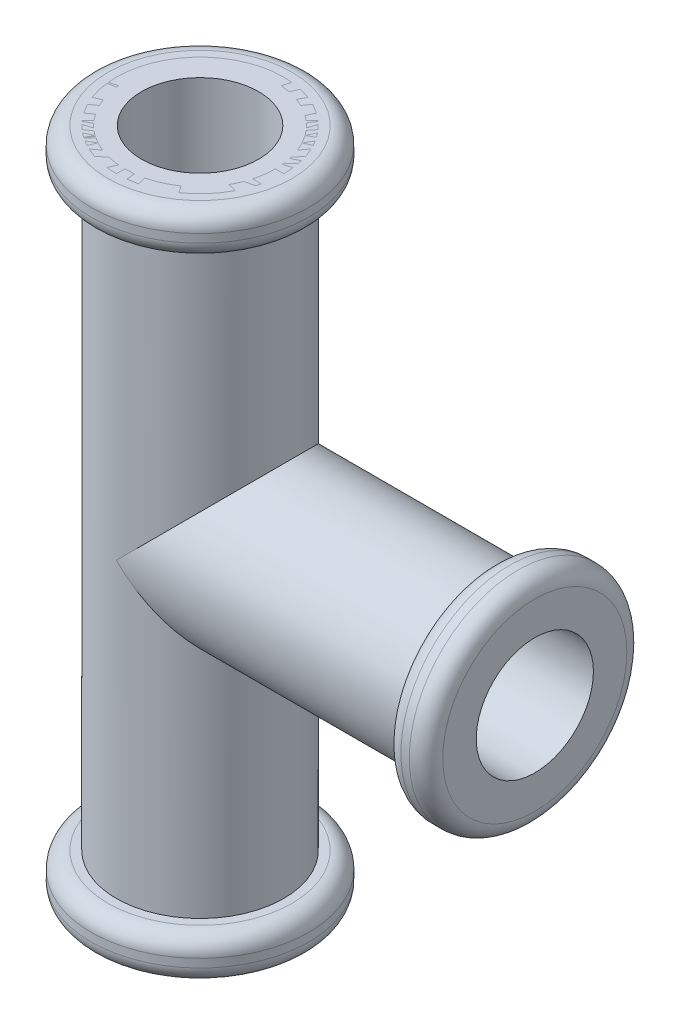
ISO-10303-21;
HEADER;
FILE_DESCRIPTION(('STEP AP214'),'2;1');
FILE_NAME('part.step','',(''),(''),'','','');
FILE_SCHEMA(('AUTOMOTIVE_DESIGN { 1 0 10303 214 1 1 1 1 }'));
ENDSEC;
DATA;
#1=APPLICATION_CONTEXT('core data for automotive mechanical design processes');
#2=APPLICATION_PROTOCOL_DEFINITION('international standard','automotive_design',2000,#1);
#3=PRODUCT_CONTEXT('',#1,'mechanical');
#4=PRODUCT('Part','Part','',(#3));
#5=PRODUCT_RELATED_PRODUCT_CATEGORY('part','',(#4));
#6=PRODUCT_DEFINITION_FORMATION('','',#4);
#7=PRODUCT_DEFINITION_CONTEXT('part definition',#1,'design');
#8=PRODUCT_DEFINITION('design','',#6,#7);
#9=PRODUCT_DEFINITION_SHAPE('','',#8);
#10=(LENGTH_UNIT() NAMED_UNIT(*) SI_UNIT(.MILLI.,.METRE.));
#11=(NAMED_UNIT(*) PLANE_ANGLE_UNIT() SI_UNIT($,.RADIAN.));
#12=(NAMED_UNIT(*) SI_UNIT($,.STERADIAN.) SOLID_ANGLE_UNIT());
#13=UNCERTAINTY_MEASURE_WITH_UNIT(LENGTH_MEASURE(1.E-05),#10,'distance_accuracy_value','');
#14=(GEOMETRIC_REPRESENTATION_CONTEXT(3) GLOBAL_UNCERTAINTY_ASSIGNED_CONTEXT((#13)) GLOBAL_UNIT_ASSIGNED_CONTEXT((#10,
#11,#12)) REPRESENTATION_CONTEXT('',''));
#15=CARTESIAN_POINT('',(0.,0.,0.));
#16=DIRECTION('',(0.,0.,1.));
#17=DIRECTION('',(1.,0.,0.));
#18=AXIS2_PLACEMENT_3D('',#15,#16,#17);
#19=CARTESIAN_POINT('',(0.,35.,0.));
#20=DIRECTION('',(0.,1.,0.));
#21=DIRECTION('',(0.,0.,1.));
#22=AXIS2_PLACEMENT_3D('',#19,#20,#21);
#23=CYLINDRICAL_SURFACE('',#22,13.);
#24=CARTESIAN_POINT('',(0.,37.,0.));
#25=DIRECTION('',(0.,1.,0.));
#26=DIRECTION('',(0.,0.,1.));
#27=AXIS2_PLACEMENT_3D('',#24,#25,#26);
#28=CIRCLE('',#27,13.);
#29=CARTESIAN_POINT('',(0.,37.,13.));
#30=VERTEX_POINT('',#29);
#31=EDGE_CURVE('E75',#30,#30,#28,.T.);
#32=ORIENTED_EDGE('',*,*,#31,.T.);
#33=EDGE_LOOP('',(#32));
#34=FACE_BOUND('',#33,.T.);
#35=CARTESIAN_POINT('',(0.,38.,0.));
#36=DIRECTION('',(0.,1.,0.));
#37=DIRECTION('',(0.,0.,1.));
#38=AXIS2_PLACEMENT_3D('',#35,#36,#37);
#39=CIRCLE('',#38,13.);
#40=CARTESIAN_POINT('',(0.,38.,13.));
#41=VERTEX_POINT('',#40);
#42=EDGE_CURVE('E80',#41,#41,#39,.F.);
#43=ORIENTED_EDGE('',*,*,#42,.T.);
#44=EDGE_LOOP('',(#43));
#45=FACE_BOUND('',#44,.T.);
#46=ADVANCED_FACE('F63',(#34,#45),#23,.T.);
#47=CARTESIAN_POINT('',(0.,40.,0.));
#48=DIRECTION('',(0.,1.,0.));
#49=DIRECTION('',(0.,0.,1.));
#50=AXIS2_PLACEMENT_3D('',#47,#48,#49);
#51=PLANE('',#50);
#52=CARTESIAN_POINT('',(0.,40.,0.));
#53=DIRECTION('',(0.,1.,0.));
#54=DIRECTION('',(0.,0.,1.));
#55=AXIS2_PLACEMENT_3D('',#52,#53,#54);
#56=CIRCLE('',#55,11.);
#57=CARTESIAN_POINT('',(0.,40.,11.));
#58=VERTEX_POINT('',#57);
#59=EDGE_CURVE('E12',#58,#58,#56,.T.);
#60=ORIENTED_EDGE('',*,*,#59,.T.);
#61=EDGE_LOOP('',(#60));
#62=FACE_BOUND('',#61,.T.);
#63=CARTESIAN_POINT('',(0.,40.,0.));
#64=DIRECTION('',(0.,1.,0.));
#65=DIRECTION('',(1.,0.,0.));
#66=AXIS2_PLACEMENT_3D('',#63,#64,#65);
#67=CIRCLE('',#66,9.);
#68=CARTESIAN_POINT('',(9.,40.,0.));
#69=VERTEX_POINT('',#68);
#70=EDGE_CURVE('E83',#69,#69,#67,.T.);
#71=ORIENTED_EDGE('',*,*,#70,.F.);
#72=EDGE_LOOP('',(#71));
#73=FACE_BOUND('',#72,.T.);
#74=ADVANCED_FACE('F102',(#62,#73),#51,.T.);
#75=CARTESIAN_POINT('',(0.,35.,0.));
#76=DIRECTION('',(0.,1.,0.));
#77=DIRECTION('',(0.,0.,1.));
#78=AXIS2_PLACEMENT_3D('',#75,#76,#77);
#79=CYLINDRICAL_SURFACE('',#78,9.);
#80=CARTESIAN_POINT('',(0.,37.,0.));
#81=DIRECTION('',(0.,1.,0.));
#82=DIRECTION('',(0.,0.,1.));
#83=AXIS2_PLACEMENT_3D('',#80,#81,#82);
#84=CIRCLE('',#83,9.);
#85=CARTESIAN_POINT('',(0.,37.,9.));
#86=VERTEX_POINT('',#85);
#87=EDGE_CURVE('E71',#86,#86,#84,.F.);
#88=ORIENTED_EDGE('',*,*,#87,.T.);
#89=EDGE_LOOP('',(#88));
#90=FACE_BOUND('',#89,.T.);
#91=ORIENTED_EDGE('',*,*,#70,.T.);
#92=EDGE_LOOP('',(#91));
#93=FACE_BOUND('',#92,.T.);
#94=ADVANCED_FACE('F95',(#90,#93),#79,.F.);
#95=CARTESIAN_POINT('',(0.,37.,0.));
#96=DIRECTION('',(0.,1.,0.));
#97=DIRECTION('',(0.,0.,1.));
#98=AXIS2_PLACEMENT_3D('',#95,#96,#97);
#99=TOROIDAL_SURFACE('',#98,11.,2.);
#100=ORIENTED_EDGE('',*,*,#87,.F.);
#101=EDGE_LOOP('',(#100));
#102=FACE_BOUND('',#101,.T.);
#103=CARTESIAN_POINT('',(0.,35.,0.));
#104=DIRECTION('',(0.,1.,0.));
#105=DIRECTION('',(0.,0.,1.));
#106=AXIS2_PLACEMENT_3D('',#103,#104,#105);
#107=CIRCLE('',#106,11.);
#108=CARTESIAN_POINT('',(0.,35.,11.));
#109=VERTEX_POINT('',#108);
#110=EDGE_CURVE('E67',#109,#109,#107,.T.);
#111=ORIENTED_EDGE('',*,*,#110,.F.);
#112=EDGE_LOOP('',(#111));
#113=FACE_BOUND('',#112,.T.);
#114=ADVANCED_FACE('F93',(#102,#113),#99,.T.);
#115=CARTESIAN_POINT('',(0.,37.,0.));
#116=DIRECTION('',(0.,1.,0.));
#117=DIRECTION('',(0.,0.,1.));
#118=AXIS2_PLACEMENT_3D('',#115,#116,#117);
#119=TOROIDAL_SURFACE('',#118,11.,2.);
#120=ORIENTED_EDGE('',*,*,#110,.T.);
#121=EDGE_LOOP('',(#120));
#122=FACE_BOUND('',#121,.T.);
#123=ORIENTED_EDGE('',*,*,#31,.F.);
#124=EDGE_LOOP('',(#123));
#125=FACE_BOUND('',#124,.T.);
#126=ADVANCED_FACE('F90',(#122,#125),#119,.T.);
#127=CARTESIAN_POINT('',(0.,38.,0.));
#128=DIRECTION('',(0.,1.,0.));
#129=DIRECTION('',(0.,0.,1.));
#130=AXIS2_PLACEMENT_3D('',#127,#128,#129);
#131=TOROIDAL_SURFACE('',#130,11.,2.);
#132=ORIENTED_EDGE('',*,*,#42,.F.);
#133=EDGE_LOOP('',(#132));
#134=FACE_BOUND('',#133,.T.);
#135=ORIENTED_EDGE('',*,*,#59,.F.);
#136=EDGE_LOOP('',(#135));
#137=FACE_BOUND('',#136,.T.);
#138=ADVANCED_FACE('F65',(#134,#137),#131,.T.);
#139=CLOSED_SHELL('',(#46,#74,#94,#114,#126,#138));
#140=MANIFOLD_SOLID_BREP('B2',#139);
#141=CARTESIAN_POINT('',(0.,40.,0.));
#142=DIRECTION('',(0.,-1.,0.));
#143=DIRECTION('',(0.,0.,-1.));
#144=AXIS2_PLACEMENT_3D('',#141,#142,#143);
#145=CYLINDRICAL_SURFACE('',#144,10.);
#146=CARTESIAN_POINT('',(0.,40.,0.));
#147=DIRECTION('',(0.,1.,0.));
#148=DIRECTION('',(0.,0.,1.));
#149=AXIS2_PLACEMENT_3D('',#146,#147,#148);
#150=CIRCLE('',#149,10.);
#151=CARTESIAN_POINT('',(0.,40.,10.));
#152=VERTEX_POINT('',#151);
#153=EDGE_CURVE('E200',#152,#152,#150,.T.);
#154=ORIENTED_EDGE('',*,*,#153,.F.);
#155=EDGE_LOOP('',(#154));
#156=FACE_BOUND('',#155,.T.);
#157=CARTESIAN_POINT('',(0.,0.,0.));
#158=DIRECTION('',(0.707106781186547,0.707106781186547,0.));
#159=DIRECTION('',(0.707106781186547,-0.707106781186547,0.));
#160=AXIS2_PLACEMENT_3D('',#157,#158,#159);
#161=ELLIPSE('',#160,14.1421356237309,10.);
#162=CARTESIAN_POINT('',(0.,0.,10.));
#163=VERTEX_POINT('',#162);
#164=CARTESIAN_POINT('',(0.,0.,-10.));
#165=VERTEX_POINT('',#164);
#166=EDGE_CURVE('E191',#163,#165,#161,.T.);
#167=ORIENTED_EDGE('',*,*,#166,.F.);
#168=CARTESIAN_POINT('',(0.,0.,0.));
#169=DIRECTION('',(0.707106781186547,-0.707106781186547,0.));
#170=DIRECTION('',(0.707106781186547,0.707106781186547,0.));
#171=AXIS2_PLACEMENT_3D('',#168,#169,#170);
#172=ELLIPSE('',#171,14.1421356237309,10.);
#173=EDGE_CURVE('E176',#165,#163,#172,.T.);
#174=ORIENTED_EDGE('',*,*,#173,.F.);
#175=EDGE_LOOP('',(#167,#174));
#176=FACE_BOUND('',#175,.T.);
#177=CARTESIAN_POINT('',(0.,-35.,0.));
#178=DIRECTION('',(0.,-1.,0.));
#179=DIRECTION('',(0.,0.,-1.));
#180=AXIS2_PLACEMENT_3D('',#177,#178,#179);
#181=CIRCLE('',#180,10.);
#182=CARTESIAN_POINT('',(0.,-35.,-10.));
#183=VERTEX_POINT('',#182);
#184=EDGE_CURVE('E205',#183,#183,#181,.T.);
#185=ORIENTED_EDGE('',*,*,#184,.F.);
#186=EDGE_LOOP('',(#185));
#187=FACE_BOUND('',#186,.T.);
#188=ADVANCED_FACE('F155',(#156,#176,#187),#145,.T.);
#189=CARTESIAN_POINT('',(-10.001,0.,0.));
#190=DIRECTION('',(1.,0.,0.));
#191=DIRECTION('',(0.,0.,-1.));
#192=AXIS2_PLACEMENT_3D('',#189,#190,#191);
#193=CYLINDRICAL_SURFACE('',#192,10.);
#194=ORIENTED_EDGE('',*,*,#166,.T.);
#195=ORIENTED_EDGE('',*,*,#173,.T.);
#196=EDGE_LOOP('',(#194,#195));
#197=FACE_BOUND('',#196,.T.);
#198=CARTESIAN_POINT('',(35.,0.,0.));
#199=DIRECTION('',(1.,0.,0.));
#200=DIRECTION('',(0.,0.,-1.));
#201=AXIS2_PLACEMENT_3D('',#198,#199,#200);
#202=CIRCLE('',#201,10.);
#203=CARTESIAN_POINT('',(35.,0.,-10.));
#204=VERTEX_POINT('',#203);
#205=EDGE_CURVE('E184',#204,#204,#202,.F.);
#206=ORIENTED_EDGE('',*,*,#205,.T.);
#207=EDGE_LOOP('',(#206));
#208=FACE_BOUND('',#207,.T.);
#209=ADVANCED_FACE('F260',(#197,#208),#193,.T.);
#210=CARTESIAN_POINT('',(0.,40.,0.));
#211=DIRECTION('',(0.,1.,0.));
#212=DIRECTION('',(0.,0.,1.));
#213=AXIS2_PLACEMENT_3D('',#210,#211,#212);
#214=PLANE('',#213);
#215=CARTESIAN_POINT('',(0.,40.,0.));
#216=DIRECTION('',(0.,1.,0.));
#217=DIRECTION('',(0.,0.,1.));
#218=AXIS2_PLACEMENT_3D('',#215,#216,#217);
#219=CIRCLE('',#218,7.);
#220=CARTESIAN_POINT('',(0.,40.,7.));
#221=VERTEX_POINT('',#220);
#222=EDGE_CURVE('E197',#221,#221,#219,.T.);
#223=ORIENTED_EDGE('',*,*,#222,.F.);
#224=EDGE_LOOP('',(#223));
#225=FACE_BOUND('',#224,.T.);
#226=ORIENTED_EDGE('',*,*,#153,.T.);
#227=EDGE_LOOP('',(#226));
#228=FACE_BOUND('',#227,.T.);
#229=ADVANCED_FACE('F266',(#225,#228),#214,.T.);
#230=CARTESIAN_POINT('',(0.,-40.,0.));
#231=DIRECTION('',(0.,1.,0.));
#232=DIRECTION('',(0.,0.,1.));
#233=AXIS2_PLACEMENT_3D('',#230,#231,#232);
#234=PLANE('',#233);
#235=CARTESIAN_POINT('',(0.,-40.,0.));
#236=DIRECTION('',(0.,1.,0.));
#237=DIRECTION('',(0.,0.,1.));
#238=AXIS2_PLACEMENT_3D('',#235,#236,#237);
#239=CIRCLE('',#238,11.);
#240=CARTESIAN_POINT('',(0.,-40.,11.));
#241=VERTEX_POINT('',#240);
#242=EDGE_CURVE('E210',#241,#241,#239,.F.);
#243=ORIENTED_EDGE('',*,*,#242,.T.);
#244=EDGE_LOOP('',(#243));
#245=FACE_BOUND('',#244,.T.);
#246=CARTESIAN_POINT('',(0.,-40.,0.));
#247=DIRECTION('',(0.,1.,0.));
#248=DIRECTION('',(0.,0.,1.));
#249=AXIS2_PLACEMENT_3D('',#246,#247,#248);
#250=CIRCLE('',#249,7.);
#251=CARTESIAN_POINT('',(0.,-40.,7.));
#252=VERTEX_POINT('',#251);
#253=EDGE_CURVE('E195',#252,#252,#250,.T.);
#254=ORIENTED_EDGE('',*,*,#253,.T.);
#255=EDGE_LOOP('',(#254));
#256=FACE_BOUND('',#255,.T.);
#257=ADVANCED_FACE('F272',(#245,#256),#234,.F.);
#258=CARTESIAN_POINT('',(0.,40.,0.));
#259=DIRECTION('',(0.,-1.,0.));
#260=DIRECTION('',(0.,0.,-1.));
#261=AXIS2_PLACEMENT_3D('',#258,#259,#260);
#262=CYLINDRICAL_SURFACE('',#261,7.);
#263=CARTESIAN_POINT('',(0.,0.,0.));
#264=DIRECTION('',(0.707106781186547,-0.707106781186547,0.));
#265=DIRECTION('',(0.707106781186547,0.707106781186547,0.));
#266=AXIS2_PLACEMENT_3D('',#263,#264,#265);
#267=ELLIPSE('',#266,9.89949493661167,7.);
#268=CARTESIAN_POINT('',(0.,0.,-7.));
#269=VERTEX_POINT('',#268);
#270=CARTESIAN_POINT('',(0.,0.,7.));
#271=VERTEX_POINT('',#270);
#272=EDGE_CURVE('E169',#269,#271,#267,.T.);
#273=ORIENTED_EDGE('',*,*,#272,.T.);
#274=CARTESIAN_POINT('',(0.,0.,0.));
#275=DIRECTION('',(0.707106781186547,0.707106781186547,0.));
#276=DIRECTION('',(0.707106781186547,-0.707106781186547,0.));
#277=AXIS2_PLACEMENT_3D('',#274,#275,#276);
#278=ELLIPSE('',#277,9.89949493661167,7.);
#279=EDGE_CURVE('E181',#271,#269,#278,.T.);
#280=ORIENTED_EDGE('',*,*,#279,.T.);
#281=EDGE_LOOP('',(#273,#280));
#282=FACE_BOUND('',#281,.T.);
#283=ORIENTED_EDGE('',*,*,#222,.T.);
#284=EDGE_LOOP('',(#283));
#285=FACE_BOUND('',#284,.T.);
#286=ORIENTED_EDGE('',*,*,#253,.F.);
#287=EDGE_LOOP('',(#286));
#288=FACE_BOUND('',#287,.T.);
#289=ADVANCED_FACE('F186',(#282,#285,#288),#262,.F.);
#290=CARTESIAN_POINT('',(40.,0.,0.));
#291=DIRECTION('',(1.,0.,0.));
#292=DIRECTION('',(0.,0.,-1.));
#293=AXIS2_PLACEMENT_3D('',#290,#291,#292);
#294=PLANE('',#293);
#295=CARTESIAN_POINT('',(40.,0.,0.));
#296=DIRECTION('',(1.,0.,0.));
#297=DIRECTION('',(0.,0.,-1.));
#298=AXIS2_PLACEMENT_3D('',#295,#296,#297);
#299=CIRCLE('',#298,11.);
#300=CARTESIAN_POINT('',(40.,0.,-11.));
#301=VERTEX_POINT('',#300);
#302=EDGE_CURVE('E61',#301,#301,#299,.T.);
#303=ORIENTED_EDGE('',*,*,#302,.T.);
#304=EDGE_LOOP('',(#303));
#305=FACE_BOUND('',#304,.T.);
#306=CARTESIAN_POINT('',(40.,0.,0.));
#307=DIRECTION('',(1.,0.,0.));
#308=DIRECTION('',(0.,0.,-1.));
#309=AXIS2_PLACEMENT_3D('',#306,#307,#308);
#310=CIRCLE('',#309,7.);
#311=CARTESIAN_POINT('',(40.,0.,-7.));
#312=VERTEX_POINT('',#311);
#313=EDGE_CURVE('E188',#312,#312,#310,.T.);
#314=ORIENTED_EDGE('',*,*,#313,.F.);
#315=EDGE_LOOP('',(#314));
#316=FACE_BOUND('',#315,.T.);
#317=ADVANCED_FACE('F249',(#305,#316),#294,.T.);
#318=CARTESIAN_POINT('',(-10.001,0.,0.));
#319=DIRECTION('',(1.,0.,0.));
#320=DIRECTION('',(0.,0.,-1.));
#321=AXIS2_PLACEMENT_3D('',#318,#319,#320);
#322=CYLINDRICAL_SURFACE('',#321,7.);
#323=ORIENTED_EDGE('',*,*,#313,.T.);
#324=EDGE_LOOP('',(#323));
#325=FACE_BOUND('',#324,.T.);
#326=ORIENTED_EDGE('',*,*,#279,.F.);
#327=ORIENTED_EDGE('',*,*,#272,.F.);
#328=EDGE_LOOP('',(#326,#327));
#329=FACE_BOUND('',#328,.T.);
#330=ADVANCED_FACE('F182',(#325,#329),#322,.F.);
#331=CARTESIAN_POINT('',(35.,0.,0.));
#332=DIRECTION('',(1.,0.,0.));
#333=DIRECTION('',(0.,0.,-1.));
#334=AXIS2_PLACEMENT_3D('',#331,#332,#333);
#335=CYLINDRICAL_SURFACE('',#334,13.);
#336=CARTESIAN_POINT('',(37.,0.,0.));
#337=DIRECTION('',(1.,0.,0.));
#338=DIRECTION('',(0.,0.,-1.));
#339=AXIS2_PLACEMENT_3D('',#336,#337,#338);
#340=CIRCLE('',#339,13.);
#341=CARTESIAN_POINT('',(37.,0.,-13.));
#342=VERTEX_POINT('',#341);
#343=EDGE_CURVE('E225',#342,#342,#340,.T.);
#344=ORIENTED_EDGE('',*,*,#343,.T.);
#345=EDGE_LOOP('',(#344));
#346=FACE_BOUND('',#345,.T.);
#347=CARTESIAN_POINT('',(38.,0.,0.));
#348=DIRECTION('',(1.,0.,0.));
#349=DIRECTION('',(0.,0.,-1.));
#350=AXIS2_PLACEMENT_3D('',#347,#348,#349);
#351=CIRCLE('',#350,13.);
#352=CARTESIAN_POINT('',(38.,0.,-13.));
#353=VERTEX_POINT('',#352);
#354=EDGE_CURVE('E222',#353,#353,#351,.F.);
#355=ORIENTED_EDGE('',*,*,#354,.T.);
#356=EDGE_LOOP('',(#355));
#357=FACE_BOUND('',#356,.T.);
#358=ADVANCED_FACE('F239',(#346,#357),#335,.T.);
#359=CARTESIAN_POINT('',(35.,0.,0.));
#360=DIRECTION('',(1.,0.,0.));
#361=DIRECTION('',(0.,0.,-1.));
#362=AXIS2_PLACEMENT_3D('',#359,#360,#361);
#363=PLANE('',#362);
#364=CARTESIAN_POINT('',(35.,0.,0.));
#365=DIRECTION('',(1.,0.,0.));
#366=DIRECTION('',(0.,0.,-1.));
#367=AXIS2_PLACEMENT_3D('',#364,#365,#366);
#368=CIRCLE('',#367,11.);
#369=CARTESIAN_POINT('',(35.,0.,-11.));
#370=VERTEX_POINT('',#369);
#371=EDGE_CURVE('E163',#370,#370,#368,.F.);
#372=ORIENTED_EDGE('',*,*,#371,.T.);
#373=EDGE_LOOP('',(#372));
#374=FACE_BOUND('',#373,.T.);
#375=ORIENTED_EDGE('',*,*,#205,.F.);
#376=EDGE_LOOP('',(#375));
#377=FACE_BOUND('',#376,.T.);
#378=ADVANCED_FACE('F230',(#374,#377),#363,.F.);
#379=CARTESIAN_POINT('',(0.,-35.,0.));
#380=DIRECTION('',(0.,-1.,0.));
#381=DIRECTION('',(0.,0.,-1.));
#382=AXIS2_PLACEMENT_3D('',#379,#380,#381);
#383=CYLINDRICAL_SURFACE('',#382,13.);
#384=CARTESIAN_POINT('',(0.,-38.,0.));
#385=DIRECTION('',(0.,1.,0.));
#386=DIRECTION('',(0.,0.,1.));
#387=AXIS2_PLACEMENT_3D('',#384,#385,#386);
#388=CIRCLE('',#387,13.);
#389=CARTESIAN_POINT('',(0.,-38.,13.));
#390=VERTEX_POINT('',#389);
#391=EDGE_CURVE('E216',#390,#390,#388,.T.);
#392=ORIENTED_EDGE('',*,*,#391,.T.);
#393=EDGE_LOOP('',(#392));
#394=FACE_BOUND('',#393,.T.);
#395=CARTESIAN_POINT('',(0.,-37.,0.));
#396=DIRECTION('',(0.,-1.,0.));
#397=DIRECTION('',(0.,0.,-1.));
#398=AXIS2_PLACEMENT_3D('',#395,#396,#397);
#399=CIRCLE('',#398,13.);
#400=CARTESIAN_POINT('',(0.,-37.,-13.));
#401=VERTEX_POINT('',#400);
#402=EDGE_CURVE('E213',#401,#401,#399,.T.);
#403=ORIENTED_EDGE('',*,*,#402,.T.);
#404=EDGE_LOOP('',(#403));
#405=FACE_BOUND('',#404,.T.);
#406=ADVANCED_FACE('F287',(#394,#405),#383,.T.);
#407=CARTESIAN_POINT('',(0.,-35.,0.));
#408=DIRECTION('',(0.,-1.,0.));
#409=DIRECTION('',(0.,0.,-1.));
#410=AXIS2_PLACEMENT_3D('',#407,#408,#409);
#411=PLANE('',#410);
#412=CARTESIAN_POINT('',(0.,-35.,0.));
#413=DIRECTION('',(0.,-1.,0.));
#414=DIRECTION('',(0.,0.,-1.));
#415=AXIS2_PLACEMENT_3D('',#412,#413,#414);
#416=CIRCLE('',#415,11.);
#417=CARTESIAN_POINT('',(0.,-35.,-11.));
#418=VERTEX_POINT('',#417);
#419=EDGE_CURVE('E219',#418,#418,#416,.F.);
#420=ORIENTED_EDGE('',*,*,#419,.T.);
#421=EDGE_LOOP('',(#420));
#422=FACE_BOUND('',#421,.T.);
#423=ORIENTED_EDGE('',*,*,#184,.T.);
#424=EDGE_LOOP('',(#423));
#425=FACE_BOUND('',#424,.T.);
#426=ADVANCED_FACE('F277',(#422,#425),#411,.F.);
#427=CARTESIAN_POINT('',(0.,-38.,0.));
#428=DIRECTION('',(0.,1.,0.));
#429=DIRECTION('',(0.,0.,1.));
#430=AXIS2_PLACEMENT_3D('',#427,#428,#429);
#431=TOROIDAL_SURFACE('',#430,11.,2.);
#432=ORIENTED_EDGE('',*,*,#391,.F.);
#433=EDGE_LOOP('',(#432));
#434=FACE_BOUND('',#433,.T.);
#435=ORIENTED_EDGE('',*,*,#242,.F.);
#436=EDGE_LOOP('',(#435));
#437=FACE_BOUND('',#436,.T.);
#438=ADVANCED_FACE('F274',(#434,#437),#431,.T.);
#439=CARTESIAN_POINT('',(0.,-37.,0.));
#440=DIRECTION('',(0.,-1.,0.));
#441=DIRECTION('',(0.,0.,-1.));
#442=AXIS2_PLACEMENT_3D('',#439,#440,#441);
#443=TOROIDAL_SURFACE('',#442,11.,2.);
#444=ORIENTED_EDGE('',*,*,#419,.F.);
#445=EDGE_LOOP('',(#444));
#446=FACE_BOUND('',#445,.T.);
#447=ORIENTED_EDGE('',*,*,#402,.F.);
#448=EDGE_LOOP('',(#447));
#449=FACE_BOUND('',#448,.T.);
#450=ADVANCED_FACE('F236',(#446,#449),#443,.T.);
#451=CARTESIAN_POINT('',(37.,0.,0.));
#452=DIRECTION('',(1.,0.,0.));
#453=DIRECTION('',(0.,0.,-1.));
#454=AXIS2_PLACEMENT_3D('',#451,#452,#453);
#455=TOROIDAL_SURFACE('',#454,11.,2.);
#456=ORIENTED_EDGE('',*,*,#371,.F.);
#457=EDGE_LOOP('',(#456));
#458=FACE_BOUND('',#457,.T.);
#459=ORIENTED_EDGE('',*,*,#343,.F.);
#460=EDGE_LOOP('',(#459));
#461=FACE_BOUND('',#460,.T.);
#462=ADVANCED_FACE('F233',(#458,#461),#455,.T.);
#463=CARTESIAN_POINT('',(38.,0.,0.));
#464=DIRECTION('',(1.,0.,0.));
#465=DIRECTION('',(0.,0.,-1.));
#466=AXIS2_PLACEMENT_3D('',#463,#464,#465);
#467=TOROIDAL_SURFACE('',#466,11.,2.);
#468=ORIENTED_EDGE('',*,*,#354,.F.);
#469=EDGE_LOOP('',(#468));
#470=FACE_BOUND('',#469,.T.);
#471=ORIENTED_EDGE('',*,*,#302,.F.);
#472=EDGE_LOOP('',(#471));
#473=FACE_BOUND('',#472,.T.);
#474=ADVANCED_FACE('F157',(#470,#473),#467,.T.);
#475=CLOSED_SHELL('',(#188,#209,#229,#257,#289,#317,#330,#358,#378,#406,#426,#438,#450,#462,#474));
#476=MANIFOLD_SOLID_BREP('B7',#475);
#477=ADVANCED_BREP_SHAPE_REPRESENTATION('',(#18,#140,#476),#14);
#478=SHAPE_DEFINITION_REPRESENTATION(#9,#477);
ENDSEC;
END-ISO-10303-21;
